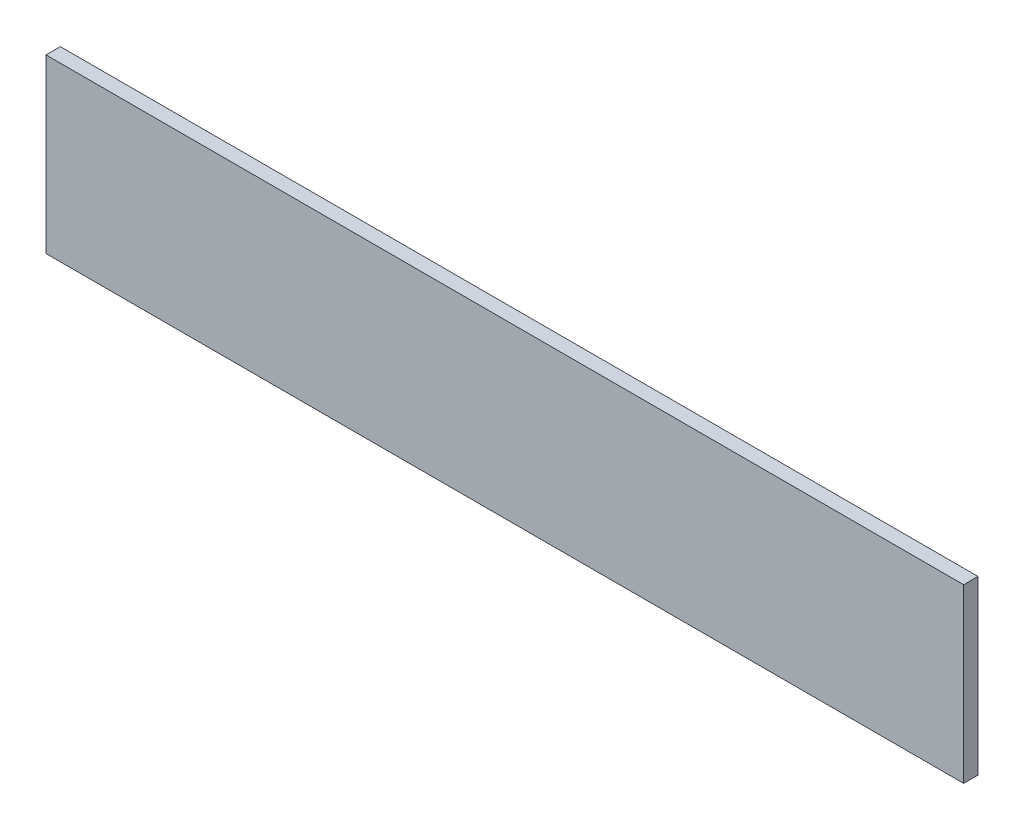
ISO-10303-21;
HEADER;
FILE_DESCRIPTION(('STEP AP214'),'2;1');
FILE_NAME('part.step','',(''),(''),'','','');
FILE_SCHEMA(('AUTOMOTIVE_DESIGN { 1 0 10303 214 1 1 1 1 }'));
ENDSEC;
DATA;
#1=APPLICATION_CONTEXT('core data for automotive mechanical design processes');
#2=APPLICATION_PROTOCOL_DEFINITION('international standard','automotive_design',2000,#1);
#3=PRODUCT_CONTEXT('',#1,'mechanical');
#4=PRODUCT('Part','Part','',(#3));
#5=PRODUCT_RELATED_PRODUCT_CATEGORY('part','',(#4));
#6=PRODUCT_DEFINITION_FORMATION('','',#4);
#7=PRODUCT_DEFINITION_CONTEXT('part definition',#1,'design');
#8=PRODUCT_DEFINITION('design','',#6,#7);
#9=PRODUCT_DEFINITION_SHAPE('','',#8);
#10=(LENGTH_UNIT() NAMED_UNIT(*) SI_UNIT(.MILLI.,.METRE.));
#11=(NAMED_UNIT(*) PLANE_ANGLE_UNIT() SI_UNIT($,.RADIAN.));
#12=(NAMED_UNIT(*) SI_UNIT($,.STERADIAN.) SOLID_ANGLE_UNIT());
#13=UNCERTAINTY_MEASURE_WITH_UNIT(LENGTH_MEASURE(1.E-05),#10,'distance_accuracy_value','');
#14=(GEOMETRIC_REPRESENTATION_CONTEXT(3) GLOBAL_UNCERTAINTY_ASSIGNED_CONTEXT((#13)) GLOBAL_UNIT_ASSIGNED_CONTEXT((#10,
#11,#12)) REPRESENTATION_CONTEXT('',''));
#15=CARTESIAN_POINT('',(0.,0.,0.));
#16=DIRECTION('',(0.,0.,1.));
#17=DIRECTION('',(1.,0.,0.));
#18=AXIS2_PLACEMENT_3D('',#15,#16,#17);
#19=CARTESIAN_POINT('',(0.,0.,6.35));
#20=DIRECTION('',(1.,0.,0.));
#21=DIRECTION('',(0.,0.,-1.));
#22=AXIS2_PLACEMENT_3D('',#19,#20,#21);
#23=PLANE('',#22);
#24=DIRECTION('',(0.,-1.,0.));
#25=VECTOR('',#24,1.);
#26=CARTESIAN_POINT('',(0.,0.,0.));
#27=LINE('',#26,#25);
#28=CARTESIAN_POINT('',(0.,76.2,0.));
#29=VERTEX_POINT('',#28);
#30=CARTESIAN_POINT('',(0.,0.,0.));
#31=VERTEX_POINT('',#30);
#32=EDGE_CURVE('E96',#29,#31,#27,.T.);
#33=ORIENTED_EDGE('',*,*,#32,.T.);
#34=DIRECTION('',(0.,0.,-1.));
#35=VECTOR('',#34,1.);
#36=CARTESIAN_POINT('',(0.,0.,6.35));
#37=LINE('',#36,#35);
#38=CARTESIAN_POINT('',(0.,0.,6.35));
#39=VERTEX_POINT('',#38);
#40=EDGE_CURVE('E11',#39,#31,#37,.T.);
#41=ORIENTED_EDGE('',*,*,#40,.F.);
#42=DIRECTION('',(0.,-1.,0.));
#43=VECTOR('',#42,1.);
#44=CARTESIAN_POINT('',(0.,0.,6.35));
#45=LINE('',#44,#43);
#46=CARTESIAN_POINT('',(0.,76.2,6.35));
#47=VERTEX_POINT('',#46);
#48=EDGE_CURVE('E84',#47,#39,#45,.T.);
#49=ORIENTED_EDGE('',*,*,#48,.F.);
#50=DIRECTION('',(0.,0.,-1.));
#51=VECTOR('',#50,1.);
#52=CARTESIAN_POINT('',(0.,76.2,6.35));
#53=LINE('',#52,#51);
#54=EDGE_CURVE('E92',#47,#29,#53,.T.);
#55=ORIENTED_EDGE('',*,*,#54,.T.);
#56=EDGE_LOOP('',(#33,#41,#49,#55));
#57=FACE_BOUND('',#56,.T.);
#58=ADVANCED_FACE('F33',(#57),#23,.F.);
#59=CARTESIAN_POINT('',(0.,0.,6.35));
#60=DIRECTION('',(0.,1.,0.));
#61=DIRECTION('',(0.,0.,1.));
#62=AXIS2_PLACEMENT_3D('',#59,#60,#61);
#63=PLANE('',#62);
#64=DIRECTION('',(1.,0.,0.));
#65=VECTOR('',#64,1.);
#66=CARTESIAN_POINT('',(0.,0.,0.));
#67=LINE('',#66,#65);
#68=CARTESIAN_POINT('',(406.4,0.,0.));
#69=VERTEX_POINT('',#68);
#70=EDGE_CURVE('E88',#31,#69,#67,.T.);
#71=ORIENTED_EDGE('',*,*,#70,.T.);
#72=DIRECTION('',(0.,0.,-1.));
#73=VECTOR('',#72,1.);
#74=CARTESIAN_POINT('',(406.4,0.,6.35));
#75=LINE('',#74,#73);
#76=CARTESIAN_POINT('',(406.4,0.,6.35));
#77=VERTEX_POINT('',#76);
#78=EDGE_CURVE('E41',#77,#69,#75,.T.);
#79=ORIENTED_EDGE('',*,*,#78,.F.);
#80=DIRECTION('',(1.,0.,0.));
#81=VECTOR('',#80,1.);
#82=CARTESIAN_POINT('',(0.,0.,6.35));
#83=LINE('',#82,#81);
#84=EDGE_CURVE('E79',#39,#77,#83,.T.);
#85=ORIENTED_EDGE('',*,*,#84,.F.);
#86=ORIENTED_EDGE('',*,*,#40,.T.);
#87=EDGE_LOOP('',(#71,#79,#85,#86));
#88=FACE_BOUND('',#87,.T.);
#89=ADVANCED_FACE('F87',(#88),#63,.F.);
#90=CARTESIAN_POINT('',(406.4,0.,6.35));
#91=DIRECTION('',(-1.,0.,0.));
#92=DIRECTION('',(0.,0.,1.));
#93=AXIS2_PLACEMENT_3D('',#90,#91,#92);
#94=PLANE('',#93);
#95=DIRECTION('',(0.,1.,0.));
#96=VECTOR('',#95,1.);
#97=CARTESIAN_POINT('',(406.4,0.,0.));
#98=LINE('',#97,#96);
#99=CARTESIAN_POINT('',(406.4,76.2,0.));
#100=VERTEX_POINT('',#99);
#101=EDGE_CURVE('E66',#69,#100,#98,.T.);
#102=ORIENTED_EDGE('',*,*,#101,.T.);
#103=DIRECTION('',(0.,0.,-1.));
#104=VECTOR('',#103,1.);
#105=CARTESIAN_POINT('',(406.4,76.2,6.35));
#106=LINE('',#105,#104);
#107=CARTESIAN_POINT('',(406.4,76.2,6.35));
#108=VERTEX_POINT('',#107);
#109=EDGE_CURVE('E89',#108,#100,#106,.T.);
#110=ORIENTED_EDGE('',*,*,#109,.F.);
#111=DIRECTION('',(0.,1.,0.));
#112=VECTOR('',#111,1.);
#113=CARTESIAN_POINT('',(406.4,0.,6.35));
#114=LINE('',#113,#112);
#115=EDGE_CURVE('E82',#77,#108,#114,.T.);
#116=ORIENTED_EDGE('',*,*,#115,.F.);
#117=ORIENTED_EDGE('',*,*,#78,.T.);
#118=EDGE_LOOP('',(#102,#110,#116,#117));
#119=FACE_BOUND('',#118,.T.);
#120=ADVANCED_FACE('F90',(#119),#94,.F.);
#121=CARTESIAN_POINT('',(0.,76.2,6.35));
#122=DIRECTION('',(0.,-1.,0.));
#123=DIRECTION('',(0.,0.,-1.));
#124=AXIS2_PLACEMENT_3D('',#121,#122,#123);
#125=PLANE('',#124);
#126=DIRECTION('',(-1.,0.,0.));
#127=VECTOR('',#126,1.);
#128=CARTESIAN_POINT('',(0.,76.2,0.));
#129=LINE('',#128,#127);
#130=EDGE_CURVE('E72',#100,#29,#129,.T.);
#131=ORIENTED_EDGE('',*,*,#130,.T.);
#132=ORIENTED_EDGE('',*,*,#54,.F.);
#133=DIRECTION('',(-1.,0.,0.));
#134=VECTOR('',#133,1.);
#135=CARTESIAN_POINT('',(0.,76.2,6.35));
#136=LINE('',#135,#134);
#137=EDGE_CURVE('E49',#108,#47,#136,.T.);
#138=ORIENTED_EDGE('',*,*,#137,.F.);
#139=ORIENTED_EDGE('',*,*,#109,.T.);
#140=EDGE_LOOP('',(#131,#132,#138,#139));
#141=FACE_BOUND('',#140,.T.);
#142=ADVANCED_FACE('F103',(#141),#125,.F.);
#143=CARTESIAN_POINT('',(0.,0.,6.35));
#144=DIRECTION('',(0.,0.,-1.));
#145=DIRECTION('',(-1.,0.,0.));
#146=AXIS2_PLACEMENT_3D('',#143,#144,#145);
#147=PLANE('',#146);
#148=ORIENTED_EDGE('',*,*,#48,.T.);
#149=ORIENTED_EDGE('',*,*,#84,.T.);
#150=ORIENTED_EDGE('',*,*,#115,.T.);
#151=ORIENTED_EDGE('',*,*,#137,.T.);
#152=EDGE_LOOP('',(#148,#149,#150,#151));
#153=FACE_BOUND('',#152,.T.);
#154=ADVANCED_FACE('F80',(#153),#147,.F.);
#155=CARTESIAN_POINT('',(0.,0.,0.));
#156=DIRECTION('',(0.,0.,-1.));
#157=DIRECTION('',(-1.,0.,0.));
#158=AXIS2_PLACEMENT_3D('',#155,#156,#157);
#159=PLANE('',#158);
#160=ORIENTED_EDGE('',*,*,#32,.F.);
#161=ORIENTED_EDGE('',*,*,#130,.F.);
#162=ORIENTED_EDGE('',*,*,#101,.F.);
#163=ORIENTED_EDGE('',*,*,#70,.F.);
#164=EDGE_LOOP('',(#160,#161,#162,#163));
#165=FACE_BOUND('',#164,.T.);
#166=ADVANCED_FACE('F106',(#165),#159,.T.);
#167=CLOSED_SHELL('',(#58,#89,#120,#142,#154,#166));
#168=MANIFOLD_SOLID_BREP('B2',#167);
#169=ADVANCED_BREP_SHAPE_REPRESENTATION('',(#18,#168),#14);
#170=SHAPE_DEFINITION_REPRESENTATION(#9,#169);
ENDSEC;
END-ISO-10303-21;
